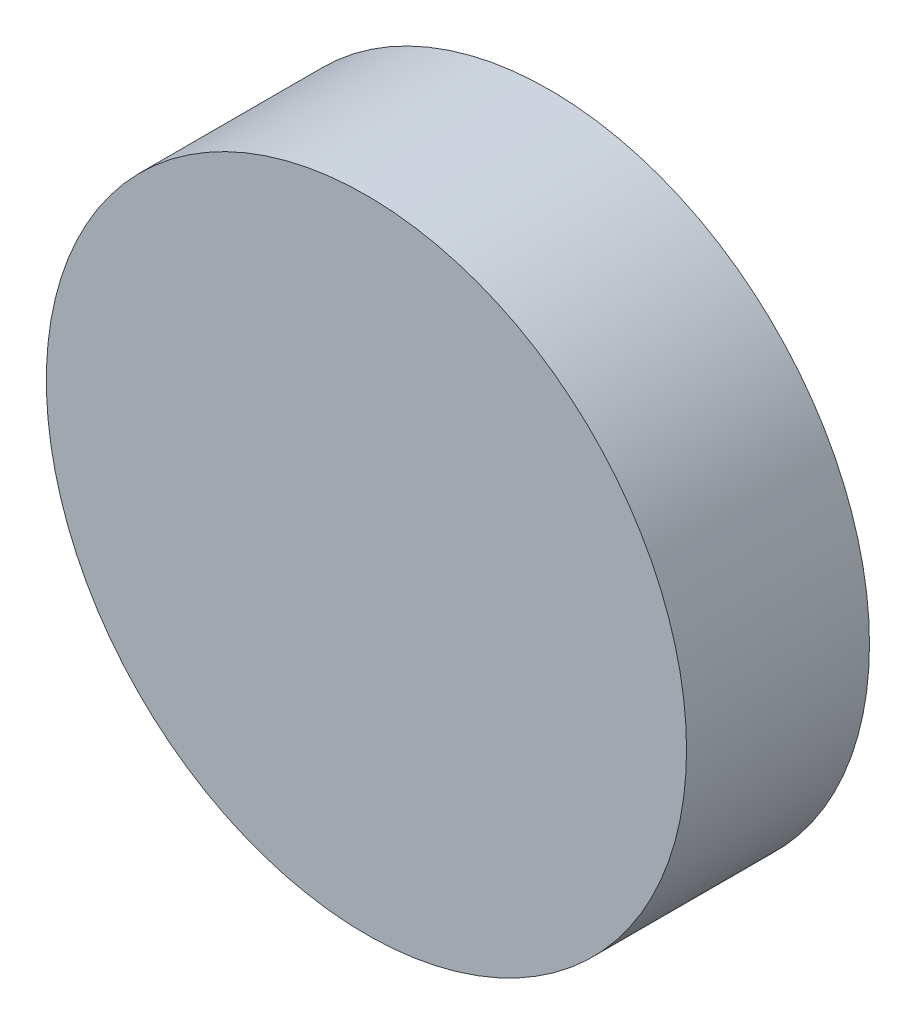
ISO-10303-21;
HEADER;
FILE_DESCRIPTION(('STEP AP214'),'2;1');
FILE_NAME('part.step','',(''),(''),'','','');
FILE_SCHEMA(('AUTOMOTIVE_DESIGN { 1 0 10303 214 1 1 1 1 }'));
ENDSEC;
DATA;
#1=APPLICATION_CONTEXT('core data for automotive mechanical design processes');
#2=APPLICATION_PROTOCOL_DEFINITION('international standard','automotive_design',2000,#1);
#3=PRODUCT_CONTEXT('',#1,'mechanical');
#4=PRODUCT('Part','Part','',(#3));
#5=PRODUCT_RELATED_PRODUCT_CATEGORY('part','',(#4));
#6=PRODUCT_DEFINITION_FORMATION('','',#4);
#7=PRODUCT_DEFINITION_CONTEXT('part definition',#1,'design');
#8=PRODUCT_DEFINITION('design','',#6,#7);
#9=PRODUCT_DEFINITION_SHAPE('','',#8);
#10=(LENGTH_UNIT() NAMED_UNIT(*) SI_UNIT(.MILLI.,.METRE.));
#11=(NAMED_UNIT(*) PLANE_ANGLE_UNIT() SI_UNIT($,.RADIAN.));
#12=(NAMED_UNIT(*) SI_UNIT($,.STERADIAN.) SOLID_ANGLE_UNIT());
#13=UNCERTAINTY_MEASURE_WITH_UNIT(LENGTH_MEASURE(1.E-05),#10,'distance_accuracy_value','');
#14=(GEOMETRIC_REPRESENTATION_CONTEXT(3) GLOBAL_UNCERTAINTY_ASSIGNED_CONTEXT((#13)) GLOBAL_UNIT_ASSIGNED_CONTEXT((#10,
#11,#12)) REPRESENTATION_CONTEXT('',''));
#15=CARTESIAN_POINT('',(0.,0.,0.));
#16=DIRECTION('',(0.,0.,1.));
#17=DIRECTION('',(1.,0.,0.));
#18=AXIS2_PLACEMENT_3D('',#15,#16,#17);
#19=CARTESIAN_POINT('',(-24.5,-5.5,-0.7));
#20=DIRECTION('',(0.,0.,-1.));
#21=DIRECTION('',(-1.,0.,0.));
#22=AXIS2_PLACEMENT_3D('',#19,#20,#21);
#23=CYLINDRICAL_SURFACE('',#22,1.75);
#24=CARTESIAN_POINT('',(-24.5,-5.5,-0.7));
#25=DIRECTION('',(0.,0.,1.));
#26=DIRECTION('',(1.,0.,0.));
#27=AXIS2_PLACEMENT_3D('',#24,#25,#26);
#28=CIRCLE('',#27,1.75);
#29=CARTESIAN_POINT('',(-22.75,-5.5,-0.7));
#30=VERTEX_POINT('',#29);
#31=EDGE_CURVE('E10',#30,#30,#28,.T.);
#32=ORIENTED_EDGE('',*,*,#31,.F.);
#33=EDGE_LOOP('',(#32));
#34=FACE_BOUND('',#33,.T.);
#35=CARTESIAN_POINT('',(-24.5,-5.5,-1.7));
#36=DIRECTION('',(0.,0.,1.));
#37=DIRECTION('',(1.,0.,0.));
#38=AXIS2_PLACEMENT_3D('',#35,#36,#37);
#39=CIRCLE('',#38,1.75);
#40=CARTESIAN_POINT('',(-22.75,-5.5,-1.7));
#41=VERTEX_POINT('',#40);
#42=EDGE_CURVE('E38',#41,#41,#39,.T.);
#43=ORIENTED_EDGE('',*,*,#42,.T.);
#44=EDGE_LOOP('',(#43));
#45=FACE_BOUND('',#44,.T.);
#46=ADVANCED_FACE('F35',(#34,#45),#23,.T.);
#47=CARTESIAN_POINT('',(-24.5,-5.5,-0.7));
#48=DIRECTION('',(0.,0.,1.));
#49=DIRECTION('',(1.,0.,0.));
#50=AXIS2_PLACEMENT_3D('',#47,#48,#49);
#51=PLANE('',#50);
#52=ORIENTED_EDGE('',*,*,#31,.T.);
#53=EDGE_LOOP('',(#52));
#54=FACE_BOUND('',#53,.T.);
#55=ADVANCED_FACE('F50',(#54),#51,.T.);
#56=CARTESIAN_POINT('',(-24.5,-5.5,-1.7));
#57=DIRECTION('',(0.,0.,1.));
#58=DIRECTION('',(1.,0.,0.));
#59=AXIS2_PLACEMENT_3D('',#56,#57,#58);
#60=PLANE('',#59);
#61=ORIENTED_EDGE('',*,*,#42,.F.);
#62=EDGE_LOOP('',(#61));
#63=FACE_BOUND('',#62,.T.);
#64=ADVANCED_FACE('F48',(#63),#60,.F.);
#65=CLOSED_SHELL('',(#46,#55,#64));
#66=MANIFOLD_SOLID_BREP('B2',#65);
#67=ADVANCED_BREP_SHAPE_REPRESENTATION('',(#18,#66),#14);
#68=SHAPE_DEFINITION_REPRESENTATION(#9,#67);
ENDSEC;
END-ISO-10303-21;
